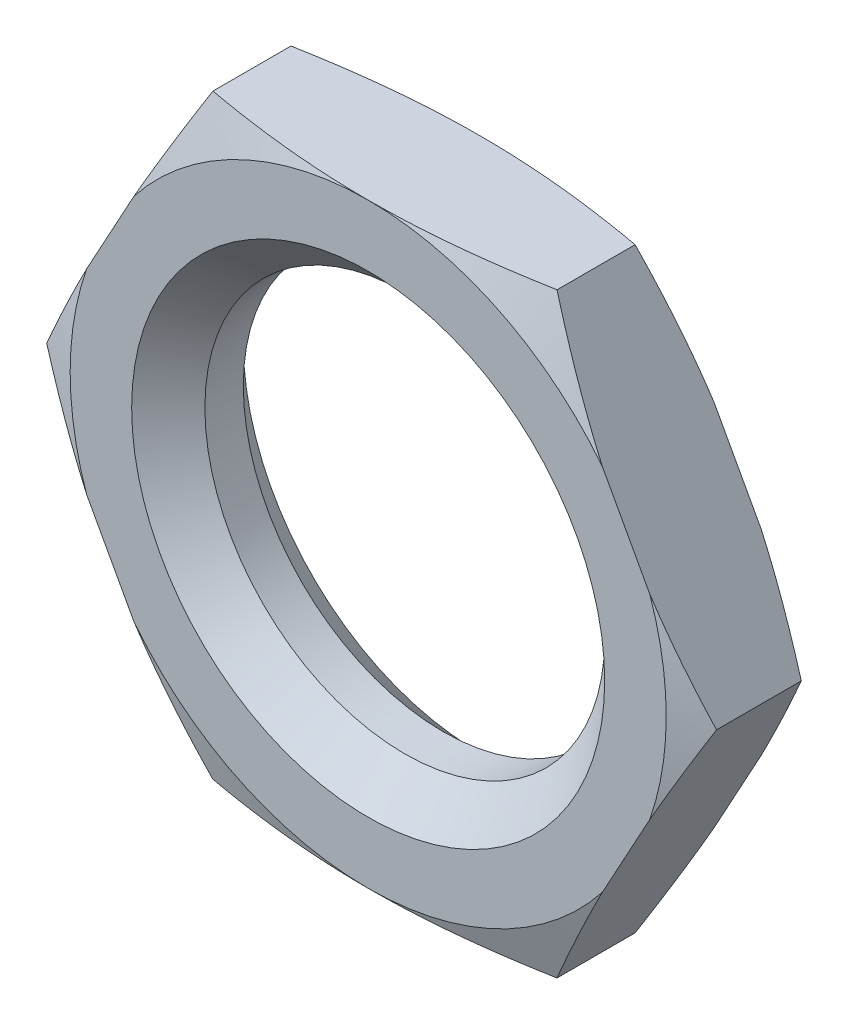
ISO-10303-21;
HEADER;
FILE_DESCRIPTION(('STEP AP214'),'2;1');
FILE_NAME('part.step','',(''),(''),'','','');
FILE_SCHEMA(('AUTOMOTIVE_DESIGN { 1 0 10303 214 1 1 1 1 }'));
ENDSEC;
DATA;
#1=APPLICATION_CONTEXT('core data for automotive mechanical design processes');
#2=APPLICATION_PROTOCOL_DEFINITION('international standard','automotive_design',2000,#1);
#3=PRODUCT_CONTEXT('',#1,'mechanical');
#4=PRODUCT('Part','Part','',(#3));
#5=PRODUCT_RELATED_PRODUCT_CATEGORY('part','',(#4));
#6=PRODUCT_DEFINITION_FORMATION('','',#4);
#7=PRODUCT_DEFINITION_CONTEXT('part definition',#1,'design');
#8=PRODUCT_DEFINITION('design','',#6,#7);
#9=PRODUCT_DEFINITION_SHAPE('','',#8);
#10=(LENGTH_UNIT() NAMED_UNIT(*) SI_UNIT(.MILLI.,.METRE.));
#11=(NAMED_UNIT(*) PLANE_ANGLE_UNIT() SI_UNIT($,.RADIAN.));
#12=(NAMED_UNIT(*) SI_UNIT($,.STERADIAN.) SOLID_ANGLE_UNIT());
#13=UNCERTAINTY_MEASURE_WITH_UNIT(LENGTH_MEASURE(1.E-05),#10,'distance_accuracy_value','');
#14=(GEOMETRIC_REPRESENTATION_CONTEXT(3) GLOBAL_UNCERTAINTY_ASSIGNED_CONTEXT((#13)) GLOBAL_UNIT_ASSIGNED_CONTEXT((#10,
#11,#12)) REPRESENTATION_CONTEXT('',''));
#15=CARTESIAN_POINT('',(0.,0.,0.));
#16=DIRECTION('',(0.,0.,1.));
#17=DIRECTION('',(1.,0.,0.));
#18=AXIS2_PLACEMENT_3D('',#15,#16,#17);
#19=CARTESIAN_POINT('',(0.,0.,0.567943896328416));
#20=DIRECTION('',(0.,0.,-1.));
#21=DIRECTION('',(-1.,0.,0.));
#22=AXIS2_PLACEMENT_3D('',#19,#20,#21);
#23=CONICAL_SURFACE('',#22,4.4987717997742,1.22173047640155);
#24=CARTESIAN_POINT('',(4.4958000232447,-4.25369351651855E-08,0.569025534528027));
#25=CARTESIAN_POINT('',(4.4365571393589,0.10841221946604,0.590588107586124));
#26=CARTESIAN_POINT('',(4.3771937332248,0.217045032676218,0.6107675941967));
#27=CARTESIAN_POINT('',(4.25828859892664,0.434636981742709,0.647962477000906));
#28=CARTESIAN_POINT('',(4.19874705074913,0.543595788230332,0.66498038394323));
#29=CARTESIAN_POINT('',(4.07944584342447,0.761912536123362,0.695491840863877));
#30=CARTESIAN_POINT('',(4.01968615622423,0.871270528864848,0.708984920099625));
#31=CARTESIAN_POINT('',(3.89994833746369,1.09038625935756,0.732120569594249));
#32=CARTESIAN_POINT('',(3.83997006964561,1.20014424645541,0.74176005873124));
#33=CARTESIAN_POINT('',(3.77992612480124,1.31002242005528,0.74930000001725));
#34=B_SPLINE_CURVE_WITH_KNOTS('',3,(#24,#25,#26,#27,#28,#29,#30,#31,#32,#33),.UNSPECIFIED.,.F.,
.F.,(4,2,2,2,4),(0.,0.376239061463251,0.752178045742061,1.12816721123019,1.50445639891164),.UNSPECIFIED.);
#35=CARTESIAN_POINT('',(4.49579997649925,-4.30054841741456E-08,0.569025551541978));
#36=VERTEX_POINT('',#35);
#37=CARTESIAN_POINT('',(3.77992612482661,1.31002242000885,0.749300000014058));
#38=VERTEX_POINT('',#37);
#39=EDGE_CURVE('E139',#36,#38,#34,.T.);
#40=ORIENTED_EDGE('',*,*,#39,.T.);
#41=CARTESIAN_POINT('',(0.,0.,0.749300000010866));
#42=DIRECTION('',(0.,0.,-1.));
#43=DIRECTION('',(-1.,0.,0.));
#44=AXIS2_PLACEMENT_3D('',#41,#42,#43);
#45=CIRCLE('',#44,4.00050000001784);
#46=CARTESIAN_POINT('',(3.77992612482661,-1.31002242000885,0.749300000014058));
#47=VERTEX_POINT('',#46);
#48=EDGE_CURVE('E144',#38,#47,#45,.T.);
#49=ORIENTED_EDGE('',*,*,#48,.T.);
#50=CARTESIAN_POINT('',(3.77992612480123,-1.31002242005528,0.74930000001725));
#51=CARTESIAN_POINT('',(3.83997006370488,-1.20014425732673,0.741760059473885));
#52=CARTESIAN_POINT('',(3.89994832559642,-1.09038628107421,0.732120571499112));
#53=CARTESIAN_POINT('',(4.01968613255412,-0.871270572180271,0.708984925058988));
#54=CARTESIAN_POINT('',(4.07944581387799,-0.761912590192304,0.695491847714452));
#55=CARTESIAN_POINT('',(4.19874700950047,-0.543595863713839,0.664980395199913));
#56=CARTESIAN_POINT('',(4.25828855185213,-0.434637067887287,0.647962490772264));
#57=CARTESIAN_POINT('',(4.37719367453437,-0.217045140077502,0.61076761351038));
#58=CARTESIAN_POINT('',(4.43655707487845,-0.108412337462838,0.590588129928255));
#59=CARTESIAN_POINT('',(4.49579995299851,-8.60109683532284E-08,0.56902556009555));
#60=B_SPLINE_CURVE_WITH_KNOTS('',3,(#50,#51,#52,#53,#54,#55,#56,#57,#58,#59),.UNSPECIFIED.,.F.,
.F.,(4,2,2,2,4),(0.,0.376289150460409,0.752278278804591,1.12821722595912,1.50445625022098),.UNSPECIFIED.);
#61=EDGE_CURVE('E21',#47,#36,#60,.T.);
#62=ORIENTED_EDGE('',*,*,#61,.T.);
#63=EDGE_LOOP('',(#40,#49,#62));
#64=FACE_BOUND('',#63,.T.);
#65=ADVANCED_FACE('F17',(#64),#23,.T.);
#66=CARTESIAN_POINT('',(0.,0.,0.567943896328416));
#67=DIRECTION('',(0.,0.,-1.));
#68=DIRECTION('',(-1.,0.,0.));
#69=AXIS2_PLACEMENT_3D('',#66,#67,#68);
#70=CONICAL_SURFACE('',#69,4.4987717997742,1.22173047640155);
#71=CARTESIAN_POINT('',(-3.77992612480123,1.31002242005528,0.74930000001725));
#72=CARTESIAN_POINT('',(-3.83997006667525,1.20014425189107,0.741760059102563));
#73=CARTESIAN_POINT('',(-3.89994833153005,1.09038627021589,0.73212057054668));
#74=CARTESIAN_POINT('',(-4.01968614438917,0.871270550522559,0.708984922579307));
#75=CARTESIAN_POINT('',(-4.07944582865123,0.761912563157833,0.695491844289165));
#76=CARTESIAN_POINT('',(-4.1987470301248,0.543595825972085,0.664980389571571));
#77=CARTESIAN_POINT('',(-4.25828857538938,0.434637024814997,0.647962483886585));
#78=CARTESIAN_POINT('',(-4.37719370387959,0.217045086376858,0.61076760385354));
#79=CARTESIAN_POINT('',(-4.43655710711868,0.108412278464437,0.59058811875719));
#80=CARTESIAN_POINT('',(-4.4957999881216,2.17370137695074E-08,0.569025547311789));
#81=B_SPLINE_CURVE_WITH_KNOTS('',3,(#71,#72,#73,#74,#75,#76,#77,#78,#79,#80),.UNSPECIFIED.,.F.,
.F.,(4,2,2,2,4),(0.,0.376289169070927,0.752278315987084,1.12821728170375,1.50445632456631),.UNSPECIFIED.);
#82=CARTESIAN_POINT('',(-3.77992612482661,1.31002242000885,0.749300000014058));
#83=VERTEX_POINT('',#82);
#84=CARTESIAN_POINT('',(-4.4957999940608,1.08685065323941E-08,0.569025545150098));
#85=VERTEX_POINT('',#84);
#86=EDGE_CURVE('E164',#83,#85,#81,.T.);
#87=ORIENTED_EDGE('',*,*,#86,.T.);
#88=CARTESIAN_POINT('',(-4.49579998812161,-2.17370160768733E-08,0.569025547311788));
#89=CARTESIAN_POINT('',(-4.43655710711868,-0.108412278464438,0.590588118757189));
#90=CARTESIAN_POINT('',(-4.37719370387959,-0.217045086376859,0.61076760385354));
#91=CARTESIAN_POINT('',(-4.25828857538939,-0.434637024814997,0.647962483886584));
#92=CARTESIAN_POINT('',(-4.19874703012481,-0.543595825972085,0.664980389571571));
#93=CARTESIAN_POINT('',(-4.07944582865123,-0.761912563157832,0.695491844289164));
#94=CARTESIAN_POINT('',(-4.01968614438917,-0.871270550522558,0.708984922579307));
#95=CARTESIAN_POINT('',(-3.89994833153006,-1.09038627021588,0.73212057054668));
#96=CARTESIAN_POINT('',(-3.83997006667525,-1.20014425189107,0.741760059102562));
#97=CARTESIAN_POINT('',(-3.77992612480124,-1.31002242005528,0.74930000001725));
#98=B_SPLINE_CURVE_WITH_KNOTS('',3,(#88,#89,#90,#91,#92,#93,#94,#95,#96,#97),.UNSPECIFIED.,.F.,
.F.,(4,2,2,2,4),(0.,0.376239042862557,0.752178008579225,1.12816715549538,1.50445632456631),.UNSPECIFIED.);
#99=CARTESIAN_POINT('',(-3.77992612482661,-1.31002242000885,0.749300000014058));
#100=VERTEX_POINT('',#99);
#101=EDGE_CURVE('E153',#85,#100,#98,.T.);
#102=ORIENTED_EDGE('',*,*,#101,.T.);
#103=CARTESIAN_POINT('',(0.,0.,0.749300000010866));
#104=DIRECTION('',(0.,0.,-1.));
#105=DIRECTION('',(-1.,0.,0.));
#106=AXIS2_PLACEMENT_3D('',#103,#104,#105);
#107=CIRCLE('',#106,4.00050000001784);
#108=EDGE_CURVE('E157',#100,#83,#107,.T.);
#109=ORIENTED_EDGE('',*,*,#108,.T.);
#110=EDGE_LOOP('',(#87,#102,#109));
#111=FACE_BOUND('',#110,.T.);
#112=ADVANCED_FACE('F172',(#111),#70,.T.);
#113=CARTESIAN_POINT('',(0.,0.,0.7493));
#114=DIRECTION('',(0.,0.,-1.));
#115=DIRECTION('',(-1.,0.,0.));
#116=AXIS2_PLACEMENT_3D('',#113,#114,#115);
#117=PLANE('',#116);
#118=CARTESIAN_POINT('',(0.,0.,0.749300000052244));
#119=DIRECTION('',(0.,0.,1.));
#120=DIRECTION('',(1.,0.,0.));
#121=AXIS2_PLACEMENT_3D('',#118,#119,#120);
#122=CIRCLE('',#121,3.17499999999882);
#123=CARTESIAN_POINT('',(3.17499999999882,0.,0.749300000052244));
#124=VERTEX_POINT('',#123);
#125=EDGE_CURVE('E584',#124,#124,#122,.F.);
#126=ORIENTED_EDGE('',*,*,#125,.T.);
#127=EDGE_LOOP('',(#126));
#128=FACE_BOUND('',#127,.T.);
#129=CARTESIAN_POINT('',(0.,0.,0.749300000010866));
#130=DIRECTION('',(0.,0.,-1.));
#131=DIRECTION('',(-1.,0.,0.));
#132=AXIS2_PLACEMENT_3D('',#129,#130,#131);
#133=CIRCLE('',#132,4.00050000001784);
#134=CARTESIAN_POINT('',(-3.14405148804756,2.47364922549016,0.749300000005433));
#135=VERTEX_POINT('',#134);
#136=CARTESIAN_POINT('',(0.,4.00050000000892,0.749300000014112));
#137=VERTEX_POINT('',#136);
#138=EDGE_CURVE('E579',#135,#137,#133,.T.);
#139=ORIENTED_EDGE('',*,*,#138,.F.);
#140=DIRECTION('',(0.479531480922707,0.877524677034256,0.));
#141=VECTOR('',#140,1.);
#142=CARTESIAN_POINT('',(-3.77992612480037,1.31002242005687,0.7493));
#143=LINE('',#142,#141);
#144=EDGE_CURVE('E582',#83,#135,#143,.T.);
#145=ORIENTED_EDGE('',*,*,#144,.F.);
#146=ORIENTED_EDGE('',*,*,#108,.F.);
#147=DIRECTION('',(-0.479531480922707,0.877524677034256,0.));
#148=VECTOR('',#147,1.);
#149=CARTESIAN_POINT('',(-3.14405148814236,-2.47364922531668,0.7493));
#150=LINE('',#149,#148);
#151=CARTESIAN_POINT('',(-3.14405148804756,-2.47364922549016,0.749300000005433));
#152=VERTEX_POINT('',#151);
#153=EDGE_CURVE('E149',#152,#100,#150,.T.);
#154=ORIENTED_EDGE('',*,*,#153,.F.);
#155=CARTESIAN_POINT('',(0.,0.,0.749300000010866));
#156=DIRECTION('',(0.,0.,-1.));
#157=DIRECTION('',(-1.,0.,0.));
#158=AXIS2_PLACEMENT_3D('',#155,#156,#157);
#159=CIRCLE('',#158,4.00050000001784);
#160=CARTESIAN_POINT('',(0.,-4.00050000000892,0.749300000014112));
#161=VERTEX_POINT('',#160);
#162=EDGE_CURVE('E603',#161,#152,#159,.T.);
#163=ORIENTED_EDGE('',*,*,#162,.F.);
#164=CARTESIAN_POINT('',(0.,0.,0.749300000010866));
#165=DIRECTION('',(0.,0.,-1.));
#166=DIRECTION('',(-1.,0.,0.));
#167=AXIS2_PLACEMENT_3D('',#164,#165,#166);
#168=CIRCLE('',#167,4.00050000001784);
#169=CARTESIAN_POINT('',(3.14405148804756,-2.47364922549016,0.749300000005433));
#170=VERTEX_POINT('',#169);
#171=EDGE_CURVE('E147',#170,#161,#168,.T.);
#172=ORIENTED_EDGE('',*,*,#171,.F.);
#173=DIRECTION('',(-0.479531480922707,-0.877524677034256,0.));
#174=VECTOR('',#173,1.);
#175=CARTESIAN_POINT('',(3.77992612480037,-1.31002242005687,0.7493));
#176=LINE('',#175,#174);
#177=EDGE_CURVE('E132',#47,#170,#176,.T.);
#178=ORIENTED_EDGE('',*,*,#177,.F.);
#179=ORIENTED_EDGE('',*,*,#48,.F.);
#180=DIRECTION('',(0.479531480922707,-0.877524677034256,0.));
#181=VECTOR('',#180,1.);
#182=CARTESIAN_POINT('',(3.14405148814236,2.47364922531668,0.7493));
#183=LINE('',#182,#181);
#184=CARTESIAN_POINT('',(3.14405148804756,2.47364922549016,0.749300000005433));
#185=VERTEX_POINT('',#184);
#186=EDGE_CURVE('E151',#185,#38,#183,.T.);
#187=ORIENTED_EDGE('',*,*,#186,.F.);
#188=CARTESIAN_POINT('',(0.,0.,0.749300000010866));
#189=DIRECTION('',(0.,0.,-1.));
#190=DIRECTION('',(-1.,0.,0.));
#191=AXIS2_PLACEMENT_3D('',#188,#189,#190);
#192=CIRCLE('',#191,4.00050000001784);
#193=EDGE_CURVE('E605',#137,#185,#192,.T.);
#194=ORIENTED_EDGE('',*,*,#193,.F.);
#195=EDGE_LOOP('',(#139,#145,#146,#154,#163,#172,#178,#179,#187,#194));
#196=FACE_BOUND('',#195,.T.);
#197=ADVANCED_FACE('F143',(#128,#196),#117,.F.);
#198=CARTESIAN_POINT('',(0.,0.,0.749300000052244));
#199=DIRECTION('',(0.,0.,1.));
#200=DIRECTION('',(1.,0.,0.));
#201=AXIS2_PLACEMENT_3D('',#198,#199,#200);
#202=CONICAL_SURFACE('',#201,3.17499999999882,0.785398163397448);
#203=ORIENTED_EDGE('',*,*,#125,.F.);
#204=EDGE_LOOP('',(#203));
#205=FACE_BOUND('',#204,.T.);
#206=CARTESIAN_POINT('',(0.,0.,0.25781));
#207=DIRECTION('',(0.,0.,1.));
#208=DIRECTION('',(1.,0.,0.));
#209=AXIS2_PLACEMENT_3D('',#206,#207,#208);
#210=CIRCLE('',#209,2.68351);
#211=CARTESIAN_POINT('',(2.68351,0.,0.25781));
#212=VERTEX_POINT('',#211);
#213=EDGE_CURVE('E573',#212,#212,#210,.F.);
#214=ORIENTED_EDGE('',*,*,#213,.T.);
#215=EDGE_LOOP('',(#214));
#216=FACE_BOUND('',#215,.T.);
#217=ADVANCED_FACE('F180',(#205,#216),#202,.F.);
#218=CARTESIAN_POINT('',(0.,0.,0.522694759808928));
#219=DIRECTION('',(0.,0.,-1.));
#220=DIRECTION('',(-1.,0.,0.));
#221=AXIS2_PLACEMENT_3D('',#218,#219,#220);
#222=CONICAL_SURFACE('',#221,4.62309278054818,1.22173047636786);
#223=CARTESIAN_POINT('',(-2.30968975189267,-4.0005,0.524046282022077));
#224=CARTESIAN_POINT('',(-2.11904174546321,-4.0005,0.558750834898958));
#225=CARTESIAN_POINT('',(-1.92777296199426,-4.0005,0.590332995433367));
#226=CARTESIAN_POINT('',(-1.54454332584392,-4.0005,0.645850789472628));
#227=CARTESIAN_POINT('',(-1.35258473669985,-4.0005,0.669802173573326));
#228=CARTESIAN_POINT('',(-0.96764741070749,-4.0005,0.708820525423857));
#229=CARTESIAN_POINT('',(-0.774668264668581,-4.0005,0.723883605647808));
#230=CARTESIAN_POINT('',(-0.484624893611577,-4.0005,0.73907060207341));
#231=CARTESIAN_POINT('',(-0.387744708693343,-4.0005,0.742898445240856));
#232=CARTESIAN_POINT('',(-0.19391137907643,-4.0005,0.748016420220229));
#233=CARTESIAN_POINT('',(-0.0969582301185669,-4.0005,0.749306390165261));
#234=CARTESIAN_POINT('',(0.,-4.0005,0.749300000017358));
#235=B_SPLINE_CURVE_WITH_KNOTS('',3,(#223,#224,#225,#226,#227,#228,#229,#230,#231,#232,#233,
#234),.UNSPECIFIED.,.F.,.F.,(4,2,2,2,2,4),(0.,0.581392397016227,1.16157685503267,
1.74201488375421,2.03285285361265,2.32370937266917),.UNSPECIFIED.);
#236=CARTESIAN_POINT('',(-2.30968975189299,-4.00049999999981,0.524046282022081));
#237=VERTEX_POINT('',#236);
#238=EDGE_CURVE('E202',#237,#161,#235,.T.);
#239=ORIENTED_EDGE('',*,*,#238,.T.);
#240=ORIENTED_EDGE('',*,*,#162,.T.);
#241=CARTESIAN_POINT('',(-3.14405148814164,-2.473649225318,0.749300000017268));
#242=CARTESIAN_POINT('',(-3.07397134721236,-2.60189326242928,0.740507062941832));
#243=CARTESIAN_POINT('',(-3.00398367441072,-2.72996808632502,0.728844522249659));
#244=CARTESIAN_POINT('',(-2.8643212233145,-2.98554514886991,0.700343139022528));
#245=CARTESIAN_POINT('',(-2.79464619973965,-3.11304783637276,0.683509556223475));
#246=CARTESIAN_POINT('',(-2.65560924732973,-3.36748025971352,0.645212950503537));
#247=CARTESIAN_POINT('',(-2.58624725594932,-3.49441011000703,0.623750898352939));
#248=CARTESIAN_POINT('',(-2.44776538094582,-3.74782676245227,0.57678062770743));
#249=CARTESIAN_POINT('',(-2.37864581459912,-3.87431298400008,0.551268323643238));
#250=CARTESIAN_POINT('',(-2.3096897518933,-4.00049999999962,0.524046282022084));
#251=B_SPLINE_CURVE_WITH_KNOTS('',3,(#241,#242,#243,#244,#245,#246,#247,#248,#249,#250),
.UNSPECIFIED.,.F.,.F.,(4,2,2,2,4),(0.,0.43916486138915,0.877884496221608,1.3165122037959,
1.75558520848354),.UNSPECIFIED.);
#252=EDGE_CURVE('E195',#152,#237,#251,.T.);
#253=ORIENTED_EDGE('',*,*,#252,.T.);
#254=EDGE_LOOP('',(#239,#240,#253));
#255=FACE_BOUND('',#254,.T.);
#256=ADVANCED_FACE('F184',(#255),#222,.T.);
#257=CARTESIAN_POINT('',(0.,0.,0.522694759808928));
#258=DIRECTION('',(0.,0.,-1.));
#259=DIRECTION('',(-1.,0.,0.));
#260=AXIS2_PLACEMENT_3D('',#257,#258,#259);
#261=CONICAL_SURFACE('',#260,4.62309278054818,1.22173047636786);
#262=CARTESIAN_POINT('',(2.30968975189331,-4.00049999999962,0.524046282022083));
#263=CARTESIAN_POINT('',(2.37864581459913,-3.87431298400008,0.551268323643237));
#264=CARTESIAN_POINT('',(2.44776538094583,-3.74782676245227,0.576780627707428));
#265=CARTESIAN_POINT('',(2.58624725594933,-3.49441011000702,0.623750898352938));
#266=CARTESIAN_POINT('',(2.65560924732973,-3.36748025971352,0.645212950503536));
#267=CARTESIAN_POINT('',(2.79464619973966,-3.11304783637276,0.683509556223475));
#268=CARTESIAN_POINT('',(2.8643212233145,-2.98554514886991,0.700343139022528));
#269=CARTESIAN_POINT('',(3.00398367441072,-2.72996808632502,0.728844522249658));
#270=CARTESIAN_POINT('',(3.07397134721236,-2.60189326242928,0.740507062941831));
#271=CARTESIAN_POINT('',(3.14405148814164,-2.473649225318,0.749300000017268));
#272=B_SPLINE_CURVE_WITH_KNOTS('',3,(#262,#263,#264,#265,#266,#267,#268,#269,#270,#271),
.UNSPECIFIED.,.F.,.F.,(4,2,2,2,4),(0.,0.439073004687638,0.877700712261928,1.31642034709439,
1.75558520848354),.UNSPECIFIED.);
#273=CARTESIAN_POINT('',(2.3096897518932,-4.00049999999981,0.524046282022041));
#274=VERTEX_POINT('',#273);
#275=EDGE_CURVE('E565',#274,#170,#272,.T.);
#276=ORIENTED_EDGE('',*,*,#275,.T.);
#277=ORIENTED_EDGE('',*,*,#171,.T.);
#278=CARTESIAN_POINT('',(0.,-4.0005,0.749300000017358));
#279=CARTESIAN_POINT('',(0.0969582301185686,-4.0005,0.749306390165261));
#280=CARTESIAN_POINT('',(0.193911379076432,-4.0005,0.748016420220229));
#281=CARTESIAN_POINT('',(0.387744708693345,-4.0005,0.742898445240856));
#282=CARTESIAN_POINT('',(0.484624893611579,-4.0005,0.73907060207341));
#283=CARTESIAN_POINT('',(0.774668264668583,-4.0005,0.723883605647808));
#284=CARTESIAN_POINT('',(0.967647410707493,-4.0005,0.708820525423857));
#285=CARTESIAN_POINT('',(1.35258473669985,-4.0005,0.669802173573326));
#286=CARTESIAN_POINT('',(1.54454332584392,-4.0005,0.645850789472627));
#287=CARTESIAN_POINT('',(1.92777296199426,-4.0005,0.590332995433366));
#288=CARTESIAN_POINT('',(2.11904174546321,-4.0005,0.558750834898958));
#289=CARTESIAN_POINT('',(2.30968975189268,-4.0005,0.524046282022077));
#290=B_SPLINE_CURVE_WITH_KNOTS('',3,(#278,#279,#280,#281,#282,#283,#284,#285,#286,#287,#288,
#289),.UNSPECIFIED.,.F.,.F.,(4,2,2,2,2,4),(0.,0.290856519056519,0.581694488914956,
1.1621325176365,1.74231697565294,2.32370937266917),.UNSPECIFIED.);
#291=EDGE_CURVE('E210',#161,#274,#290,.T.);
#292=ORIENTED_EDGE('',*,*,#291,.T.);
#293=EDGE_LOOP('',(#276,#277,#292));
#294=FACE_BOUND('',#293,.T.);
#295=ADVANCED_FACE('F189',(#294),#261,.T.);
#296=CARTESIAN_POINT('',(0.,0.,0.522694759808928));
#297=DIRECTION('',(0.,0.,-1.));
#298=DIRECTION('',(-1.,0.,0.));
#299=AXIS2_PLACEMENT_3D('',#296,#297,#298);
#300=CONICAL_SURFACE('',#299,4.62309278054818,1.22173047636786);
#301=CARTESIAN_POINT('',(2.30968975189268,4.0005,0.524046282022077));
#302=CARTESIAN_POINT('',(2.11904174546321,4.0005,0.558750834898958));
#303=CARTESIAN_POINT('',(1.92777296199426,4.0005,0.590332995433367));
#304=CARTESIAN_POINT('',(1.54454332584392,4.0005,0.645850789472628));
#305=CARTESIAN_POINT('',(1.35258473669985,4.0005,0.669802173573326));
#306=CARTESIAN_POINT('',(0.967647410707491,4.0005,0.708820525423857));
#307=CARTESIAN_POINT('',(0.774668264668582,4.0005,0.723883605647808));
#308=CARTESIAN_POINT('',(0.484624893611578,4.0005,0.73907060207341));
#309=CARTESIAN_POINT('',(0.387744708693344,4.0005,0.742898445240856));
#310=CARTESIAN_POINT('',(0.193911379076431,4.0005,0.748016420220229));
#311=CARTESIAN_POINT('',(0.0969582301185679,4.0005,0.749306390165261));
#312=CARTESIAN_POINT('',(0.,4.0005,0.749300000017358));
#313=B_SPLINE_CURVE_WITH_KNOTS('',3,(#301,#302,#303,#304,#305,#306,#307,#308,#309,#310,#311,
#312),.UNSPECIFIED.,.F.,.F.,(4,2,2,2,2,4),(0.,0.581392397016227,1.16157685503267,
1.74201488375421,2.03285285361265,2.32370937266917),.UNSPECIFIED.);
#314=CARTESIAN_POINT('',(2.30968975189299,4.00049999999981,0.52404628202208));
#315=VERTEX_POINT('',#314);
#316=EDGE_CURVE('E288',#315,#137,#313,.T.);
#317=ORIENTED_EDGE('',*,*,#316,.T.);
#318=ORIENTED_EDGE('',*,*,#193,.T.);
#319=CARTESIAN_POINT('',(3.14405148814164,2.473649225318,0.749300000017268));
#320=CARTESIAN_POINT('',(3.07397134721236,2.60189326242928,0.740507062941832));
#321=CARTESIAN_POINT('',(3.00398367441072,2.72996808632502,0.728844522249659));
#322=CARTESIAN_POINT('',(2.8643212233145,2.98554514886991,0.700343139022529));
#323=CARTESIAN_POINT('',(2.79464619973965,3.11304783637276,0.683509556223475));
#324=CARTESIAN_POINT('',(2.65560924732973,3.36748025971352,0.645212950503537));
#325=CARTESIAN_POINT('',(2.58624725594932,3.49441011000702,0.623750898352939));
#326=CARTESIAN_POINT('',(2.44776538094582,3.74782676245227,0.57678062770743));
#327=CARTESIAN_POINT('',(2.37864581459912,3.87431298400008,0.551268323643238));
#328=CARTESIAN_POINT('',(2.3096897518933,4.00049999999962,0.524046282022084));
#329=B_SPLINE_CURVE_WITH_KNOTS('',3,(#319,#320,#321,#322,#323,#324,#325,#326,#327,#328),
.UNSPECIFIED.,.F.,.F.,(4,2,2,2,4),(0.,0.43916486138915,0.877884496221607,1.3165122037959,
1.75558520848354),.UNSPECIFIED.);
#330=EDGE_CURVE('E309',#185,#315,#329,.T.);
#331=ORIENTED_EDGE('',*,*,#330,.T.);
#332=EDGE_LOOP('',(#317,#318,#331));
#333=FACE_BOUND('',#332,.T.);
#334=ADVANCED_FACE('F299',(#333),#300,.T.);
#335=CARTESIAN_POINT('',(0.,0.,0.522694759808928));
#336=DIRECTION('',(0.,0.,-1.));
#337=DIRECTION('',(-1.,0.,0.));
#338=AXIS2_PLACEMENT_3D('',#335,#336,#337);
#339=CONICAL_SURFACE('',#338,4.62309278054818,1.22173047636786);
#340=CARTESIAN_POINT('',(-2.30968975189331,4.00049999999962,0.524046282022083));
#341=CARTESIAN_POINT('',(-2.37864581459913,3.87431298400008,0.551268323643237));
#342=CARTESIAN_POINT('',(-2.44776538094583,3.74782676245227,0.576780627707429));
#343=CARTESIAN_POINT('',(-2.58624725594933,3.49441011000703,0.623750898352938));
#344=CARTESIAN_POINT('',(-2.65560924732973,3.36748025971352,0.645212950503536));
#345=CARTESIAN_POINT('',(-2.79464619973966,3.11304783637276,0.683509556223474));
#346=CARTESIAN_POINT('',(-2.8643212233145,2.98554514886991,0.700343139022528));
#347=CARTESIAN_POINT('',(-3.00398367441072,2.72996808632502,0.728844522249658));
#348=CARTESIAN_POINT('',(-3.07397134721236,2.60189326242928,0.740507062941832));
#349=CARTESIAN_POINT('',(-3.14405148814164,2.473649225318,0.749300000017268));
#350=B_SPLINE_CURVE_WITH_KNOTS('',3,(#340,#341,#342,#343,#344,#345,#346,#347,#348,#349),
.UNSPECIFIED.,.F.,.F.,(4,2,2,2,4),(0.,0.439073004687638,0.877700712261928,1.31642034709439,
1.75558520848354),.UNSPECIFIED.);
#351=CARTESIAN_POINT('',(-2.3096897518932,4.00049999999981,0.524046282022041));
#352=VERTEX_POINT('',#351);
#353=EDGE_CURVE('E303',#352,#135,#350,.T.);
#354=ORIENTED_EDGE('',*,*,#353,.T.);
#355=ORIENTED_EDGE('',*,*,#138,.T.);
#356=CARTESIAN_POINT('',(0.,4.0005,0.749300000017358));
#357=CARTESIAN_POINT('',(-0.0969582301185686,4.0005,0.749306390165261));
#358=CARTESIAN_POINT('',(-0.193911379076432,4.0005,0.748016420220229));
#359=CARTESIAN_POINT('',(-0.387744708693345,4.0005,0.742898445240856));
#360=CARTESIAN_POINT('',(-0.484624893611579,4.0005,0.73907060207341));
#361=CARTESIAN_POINT('',(-0.774668264668583,4.0005,0.723883605647808));
#362=CARTESIAN_POINT('',(-0.967647410707493,4.0005,0.708820525423857));
#363=CARTESIAN_POINT('',(-1.35258473669985,4.0005,0.669802173573326));
#364=CARTESIAN_POINT('',(-1.54454332584392,4.0005,0.645850789472627));
#365=CARTESIAN_POINT('',(-1.92777296199426,4.0005,0.590332995433366));
#366=CARTESIAN_POINT('',(-2.11904174546321,4.0005,0.558750834898958));
#367=CARTESIAN_POINT('',(-2.30968975189268,4.0005,0.524046282022077));
#368=B_SPLINE_CURVE_WITH_KNOTS('',3,(#356,#357,#358,#359,#360,#361,#362,#363,#364,#365,#366,
#367),.UNSPECIFIED.,.F.,.F.,(4,2,2,2,2,4),(0.,0.290856519056519,0.581694488914956,
1.1621325176365,1.74231697565294,2.32370937266917),.UNSPECIFIED.);
#369=EDGE_CURVE('E280',#137,#352,#368,.T.);
#370=ORIENTED_EDGE('',*,*,#369,.T.);
#371=EDGE_LOOP('',(#354,#355,#370));
#372=FACE_BOUND('',#371,.T.);
#373=ADVANCED_FACE('F295',(#372),#339,.T.);
#374=CARTESIAN_POINT('',(0.,0.,-0.7493));
#375=DIRECTION('',(0.,0.,1.));
#376=DIRECTION('',(1.,0.,0.));
#377=AXIS2_PLACEMENT_3D('',#374,#375,#376);
#378=CYLINDRICAL_SURFACE('',#377,2.68351);
#379=ORIENTED_EDGE('',*,*,#213,.F.);
#380=EDGE_LOOP('',(#379));
#381=FACE_BOUND('',#380,.T.);
#382=CARTESIAN_POINT('',(0.,0.,-0.25781000005054));
#383=DIRECTION('',(0.,0.,-1.));
#384=DIRECTION('',(-1.,0.,0.));
#385=AXIS2_PLACEMENT_3D('',#382,#383,#384);
#386=CIRCLE('',#385,2.68350999999711);
#387=CARTESIAN_POINT('',(-2.68350999999711,0.,-0.25781000005054));
#388=VERTEX_POINT('',#387);
#389=EDGE_CURVE('E279',#388,#388,#386,.T.);
#390=ORIENTED_EDGE('',*,*,#389,.T.);
#391=EDGE_LOOP('',(#390));
#392=FACE_BOUND('',#391,.T.);
#393=ADVANCED_FACE('F298',(#381,#392),#378,.F.);
#394=CARTESIAN_POINT('',(-4.4958,0.,1.4986));
#395=DIRECTION('',(0.877524677034256,0.479531480922707,0.));
#396=DIRECTION('',(-0.479531480922707,0.877524677034256,0.));
#397=AXIS2_PLACEMENT_3D('',#394,#395,#396);
#398=PLANE('',#397);
#399=CARTESIAN_POINT('',(-3.77992612480025,-1.31002242005708,-0.74929999996053));
#400=CARTESIAN_POINT('',(-3.83997006370371,-1.20014425732887,-0.741760059416569));
#401=CARTESIAN_POINT('',(-3.89994832559505,-1.09038628107673,-0.732120571441034));
#402=CARTESIAN_POINT('',(-4.0196861325523,-0.871270572183592,-0.708984924999092));
#403=CARTESIAN_POINT('',(-4.07944581387594,-0.761912590196059,-0.695491847653498));
#404=CARTESIAN_POINT('',(-4.19874700949791,-0.543595863718524,-0.664980395136579));
#405=CARTESIAN_POINT('',(-4.2582885518493,-0.434637067892468,-0.647962490707607));
#406=CARTESIAN_POINT('',(-4.37719367453097,-0.217045140083728,-0.610767613442844));
#407=CARTESIAN_POINT('',(-4.43655707487475,-0.108412337469612,-0.59058812985916));
#408=CARTESIAN_POINT('',(-4.49579995299449,-8.6018323776957E-08,-0.569025560024796));
#409=B_SPLINE_CURVE_WITH_KNOTS('',3,(#399,#400,#401,#402,#403,#404,#405,#406,#407,#408),
.UNSPECIFIED.,.F.,.F.,(4,2,2,2,4),(0.,0.376289150459314,0.752278278802354,1.12821722595573,
1.50445625021649),.UNSPECIFIED.);
#410=CARTESIAN_POINT('',(-3.77992612466924,-1.31002242029683,-0.749299999977011));
#411=VERTEX_POINT('',#410);
#412=CARTESIAN_POINT('',(-4.49579997649724,-4.30091624879934E-08,-0.569025551470494));
#413=VERTEX_POINT('',#412);
#414=EDGE_CURVE('E274',#411,#413,#409,.T.);
#415=ORIENTED_EDGE('',*,*,#414,.F.);
#416=DIRECTION('',(-0.479531480922707,0.877524677034256,0.));
#417=VECTOR('',#416,1.);
#418=CARTESIAN_POINT('',(-4.4958,0.,-0.7493));
#419=LINE('',#418,#417);
#420=CARTESIAN_POINT('',(-3.14405148827349,-2.47364922507671,-0.749299999977011));
#421=VERTEX_POINT('',#420);
#422=EDGE_CURVE('E386',#421,#411,#419,.T.);
#423=ORIENTED_EDGE('',*,*,#422,.F.);
#424=CARTESIAN_POINT('',(-2.30968970048862,-4.00050001039158,-0.524046245356606));
#425=CARTESIAN_POINT('',(-2.37864578572553,-3.87431300663461,-0.551268306625714));
#426=CARTESIAN_POINT('',(-2.44776536232619,-3.74782678839761,-0.576780619307495));
#427=CARTESIAN_POINT('',(-2.586247246869,-3.49441013474332,-0.623750897259498));
#428=CARTESIAN_POINT('',(-2.6556092375455,-3.36748027993856,-0.645212948112841));
#429=CARTESIAN_POINT('',(-2.79464619118052,-3.11304784971489,-0.683509553456973));
#430=CARTESIAN_POINT('',(-2.86432121668448,-2.98554515984161,-0.700343137184934));
#431=CARTESIAN_POINT('',(-3.00398367173033,-2.72996809239218,-0.728844522078744));
#432=CARTESIAN_POINT('',(-3.07397134655275,-2.60189326596181,-0.740507063502767));
#433=CARTESIAN_POINT('',(-3.14405148814247,-2.47364922531646,-0.74929999996053));
#434=B_SPLINE_CURVE_WITH_KNOTS('',3,(#424,#425,#426,#427,#428,#429,#430,#431,#432,#433),
.UNSPECIFIED.,.F.,.F.,(4,2,2,2,4),(0.,0.439073015116604,0.877700732694713,1.31642037687126,
1.75558524809707),.UNSPECIFIED.);
#435=CARTESIAN_POINT('',(-2.30968970615158,-4.0005,-0.524046290302312));
#436=VERTEX_POINT('',#435);
#437=EDGE_CURVE('E249',#436,#421,#434,.T.);
#438=ORIENTED_EDGE('',*,*,#437,.F.);
#439=DIRECTION('',(0.,0.,1.));
#440=VECTOR('',#439,1.);
#441=CARTESIAN_POINT('',(-2.3096897518931,-4.0005,1.4986));
#442=LINE('',#441,#440);
#443=EDGE_CURVE('E598',#436,#237,#442,.T.);
#444=ORIENTED_EDGE('',*,*,#443,.T.);
#445=ORIENTED_EDGE('',*,*,#252,.F.);
#446=ORIENTED_EDGE('',*,*,#153,.T.);
#447=ORIENTED_EDGE('',*,*,#101,.F.);
#448=DIRECTION('',(0.,0.,1.));
#449=VECTOR('',#448,1.);
#450=CARTESIAN_POINT('',(-4.4958,0.,1.4986));
#451=LINE('',#450,#449);
#452=EDGE_CURVE('E308',#85,#413,#451,.F.);
#453=ORIENTED_EDGE('',*,*,#452,.T.);
#454=EDGE_LOOP('',(#415,#423,#438,#444,#445,#446,#447,#453));
#455=FACE_BOUND('',#454,.T.);
#456=ADVANCED_FACE('F169',(#455),#398,.F.);
#457=CARTESIAN_POINT('',(2.3096897518931,-4.0005,1.4986));
#458=DIRECTION('',(-0.877524677034257,0.479531480922706,0.));
#459=DIRECTION('',(-0.479531480922706,-0.877524677034257,0.));
#460=AXIS2_PLACEMENT_3D('',#457,#458,#459);
#461=PLANE('',#460);
#462=CARTESIAN_POINT('',(3.14405148814247,-2.47364922531647,-0.749299999960529));
#463=CARTESIAN_POINT('',(3.07397135098923,-2.60189325551775,-0.740507063356418));
#464=CARTESIAN_POINT('',(3.00398368195243,-2.72996807252398,-0.728844523448548));
#465=CARTESIAN_POINT('',(2.86432123834689,-2.9855451213612,-0.700343142318569));
#466=CARTESIAN_POINT('',(2.79464621849794,-3.1130478020458,-0.683509560831398));
#467=CARTESIAN_POINT('',(2.65560927350044,-3.3674802118221,-0.64521295816839));
#468=CARTESIAN_POINT('',(2.58624728580659,-3.49441005536935,-0.623750907762598));
#469=CARTESIAN_POINT('',(2.44776541815075,-3.74782669436865,-0.576780640946737));
#470=CARTESIAN_POINT('',(2.3786458554651,-3.87431290921687,-0.551268338968061));
#471=CARTESIAN_POINT('',(2.30968979640353,-4.00049991854758,-0.524046299552212));
#472=B_SPLINE_CURVE_WITH_KNOTS('',3,(#462,#463,#464,#465,#466,#467,#468,#469,#470,#471),
.UNSPECIFIED.,.F.,.F.,(4,2,2,2,4),(0.,0.439164837734707,0.87788444897294,1.31651213297218,
1.75558511402455),.UNSPECIFIED.);
#473=CARTESIAN_POINT('',(3.14405148827349,-2.47364922507671,-0.749299999977011));
#474=VERTEX_POINT('',#473);
#475=CARTESIAN_POINT('',(2.30968977414815,-4.00049995927408,-0.52404629076506));
#476=VERTEX_POINT('',#475);
#477=EDGE_CURVE('E365',#474,#476,#472,.T.);
#478=ORIENTED_EDGE('',*,*,#477,.F.);
#479=DIRECTION('',(-0.479531480922706,-0.877524677034257,0.));
#480=VECTOR('',#479,1.);
#481=CARTESIAN_POINT('',(2.3096897518931,-4.0005,-0.7493));
#482=LINE('',#481,#480);
#483=CARTESIAN_POINT('',(3.77992612466924,-1.31002242029683,-0.749299999977011));
#484=VERTEX_POINT('',#483);
#485=EDGE_CURVE('E211',#484,#474,#482,.T.);
#486=ORIENTED_EDGE('',*,*,#485,.F.);
#487=CARTESIAN_POINT('',(4.49579996878491,-1.41418048295316E-08,-0.569025532344247));
#488=CARTESIAN_POINT('',(4.43655710005208,-0.108412275880736,-0.5905881133399));
#489=CARTESIAN_POINT('',(4.37719370186082,-0.217045085895431,-0.610767602384426));
#490=CARTESIAN_POINT('',(4.2582885770771,-0.434637025898906,-0.647962485323522));
#491=CARTESIAN_POINT('',(4.1987470304764,-0.543595826520912,-0.664980389971914));
#492=CARTESIAN_POINT('',(4.0794458279804,-0.76191256319304,-0.695491843844935));
#493=CARTESIAN_POINT('',(4.0196861440324,-0.871270550579001,-0.708984922330129));
#494=CARTESIAN_POINT('',(3.89994833176863,-1.09038627037621,-0.73212057070031));
#495=CARTESIAN_POINT('',(3.83997006719502,-1.20014425213421,-0.741760059461778));
#496=CARTESIAN_POINT('',(3.77992612479978,-1.31002242005794,-0.749299999960589));
#497=B_SPLINE_CURVE_WITH_KNOTS('',3,(#487,#488,#489,#490,#491,#492,#493,#494,#495,#496),
.UNSPECIFIED.,.F.,.F.,(4,2,2,2,4),(0.,0.376239043057248,0.752178008782089,1.12816715540123,
1.50445632438666),.UNSPECIFIED.);
#498=CARTESIAN_POINT('',(4.49579999405898,-1.08718324495034E-08,-0.569025545078543));
#499=VERTEX_POINT('',#498);
#500=EDGE_CURVE('E216',#499,#484,#497,.T.);
#501=ORIENTED_EDGE('',*,*,#500,.F.);
#502=DIRECTION('',(0.,0.,1.));
#503=VECTOR('',#502,1.);
#504=CARTESIAN_POINT('',(4.4958,0.,1.4986));
#505=LINE('',#504,#503);
#506=EDGE_CURVE('E135',#499,#36,#505,.T.);
#507=ORIENTED_EDGE('',*,*,#506,.T.);
#508=ORIENTED_EDGE('',*,*,#61,.F.);
#509=ORIENTED_EDGE('',*,*,#177,.T.);
#510=ORIENTED_EDGE('',*,*,#275,.F.);
#511=DIRECTION('',(0.,0.,1.));
#512=VECTOR('',#511,1.);
#513=CARTESIAN_POINT('',(2.3096897518931,-4.0005,1.4986));
#514=LINE('',#513,#512);
#515=EDGE_CURVE('E599',#274,#476,#514,.F.);
#516=ORIENTED_EDGE('',*,*,#515,.T.);
#517=EDGE_LOOP('',(#478,#486,#501,#507,#508,#509,#510,#516));
#518=FACE_BOUND('',#517,.T.);
#519=ADVANCED_FACE('F131',(#518),#461,.F.);
#520=CARTESIAN_POINT('',(-2.3096897518931,-4.0005,1.4986));
#521=DIRECTION('',(0.,1.,0.));
#522=DIRECTION('',(0.,0.,1.));
#523=AXIS2_PLACEMENT_3D('',#520,#521,#522);
#524=PLANE('',#523);
#525=CARTESIAN_POINT('',(0.,-4.0005,-0.749299999960514));
#526=CARTESIAN_POINT('',(-0.0969582262290942,-4.0005,-0.749306390107406));
#527=CARTESIAN_POINT('',(-0.193911371298117,-4.0005,-0.748016420266491));
#528=CARTESIAN_POINT('',(-0.387744693146543,-4.0005,-0.742898445696903));
#529=CARTESIAN_POINT('',(-0.48462487418513,-4.0005,-0.739070602835086));
#530=CARTESIAN_POINT('',(-0.774668233665641,-4.0005,-0.723883607612678));
#531=CARTESIAN_POINT('',(-0.967647372029481,-4.0005,-0.708820528572697));
#532=CARTESIAN_POINT('',(-1.35258468278679,-4.0005,-0.669802179703828));
#533=CARTESIAN_POINT('',(-1.54454326437078,-4.0005,-0.64585079740005));
#534=CARTESIAN_POINT('',(-1.92777288546119,-4.0005,-0.590333007404434));
#535=CARTESIAN_POINT('',(-2.11904166143063,-4.0005,-0.558750849118604));
#536=CARTESIAN_POINT('',(-2.30968966041007,-4.0005,-0.524046298626586));
#537=B_SPLINE_CURVE_WITH_KNOTS('',3,(#525,#526,#527,#528,#529,#530,#531,#532,#533,#534,#535,
#536),.UNSPECIFIED.,.F.,.F.,(4,2,2,2,2,4),(0.,0.29085650739029,0.581694465586214,
1.16213247110448,1.74231690596055,2.32370927969665),.UNSPECIFIED.);
#538=CARTESIAN_POINT('',(0.,-4.00050000000892,-0.749299999957268));
#539=VERTEX_POINT('',#538);
#540=EDGE_CURVE('E241',#539,#436,#537,.T.);
#541=ORIENTED_EDGE('',*,*,#540,.F.);
#542=CARTESIAN_POINT('',(2.30968978646365,-4.00049995928065,-0.524046245189128));
#543=CARTESIAN_POINT('',(2.11904177969625,-4.00049998541225,-0.558750818140077));
#544=CARTESIAN_POINT('',(1.92777299402471,-4.00049999609993,-0.590332987450093));
#545=CARTESIAN_POINT('',(1.54454335200846,-4.00050000389196,-0.645850788918709));
#546=CARTESIAN_POINT('',(1.35258475920564,-4.00050000102448,-0.669802171701882));
#547=CARTESIAN_POINT('',(0.96764742660677,-4.00049999897507,-0.708820523294937));
#548=CARTESIAN_POINT('',(0.774668277621797,-4.00049999979475,-0.723883604594609));
#549=CARTESIAN_POINT('',(0.484624901918033,-4.00050000010284,-0.739070601742504));
#550=CARTESIAN_POINT('',(0.387744715362696,-4.00050000005142,-0.742898445001835));
#551=CARTESIAN_POINT('',(0.193911382425239,-4.00049999994857,-0.74801642008162));
#552=CARTESIAN_POINT('',(0.0969582317839057,-4.00049999989714,-0.749306390034052));
#553=CARTESIAN_POINT('',(0.,-4.0005,-0.749299999960514));
#554=B_SPLINE_CURVE_WITH_KNOTS('',3,(#542,#543,#544,#545,#546,#547,#548,#549,#550,#551,#552,
#553),.UNSPECIFIED.,.F.,.F.,(4,2,2,2,2,4),(0.,0.581392407790235,1.16157687595997,
1.74201491388605,2.03285288864741,2.32370941273581),.UNSPECIFIED.);
#555=EDGE_CURVE('E233',#476,#539,#554,.T.);
#556=ORIENTED_EDGE('',*,*,#555,.F.);
#557=ORIENTED_EDGE('',*,*,#515,.F.);
#558=ORIENTED_EDGE('',*,*,#291,.F.);
#559=ORIENTED_EDGE('',*,*,#238,.F.);
#560=ORIENTED_EDGE('',*,*,#443,.F.);
#561=EDGE_LOOP('',(#541,#556,#557,#558,#559,#560));
#562=FACE_BOUND('',#561,.T.);
#563=ADVANCED_FACE('F221',(#562),#524,.F.);
#564=CARTESIAN_POINT('',(4.4958,0.,1.4986));
#565=DIRECTION('',(-0.877524677034256,-0.479531480922707,0.));
#566=DIRECTION('',(0.479531480922707,-0.877524677034256,0.));
#567=AXIS2_PLACEMENT_3D('',#564,#565,#566);
#568=PLANE('',#567);
#569=CARTESIAN_POINT('',(3.77992612480025,1.31002242005707,-0.74929999996053));
#570=CARTESIAN_POINT('',(3.83997006660583,1.2001442520181,-0.741760059053778));
#571=CARTESIAN_POINT('',(3.89994833139235,1.09038627046788,-0.732120570510486));
#572=CARTESIAN_POINT('',(4.01968614411544,0.871270551023485,-0.708984922576383));
#573=CARTESIAN_POINT('',(4.07944582830975,0.761912563782729,-0.69549184430691));
#574=CARTESIAN_POINT('',(4.19874702964838,0.543595826843922,-0.664980389637554));
#575=CARTESIAN_POINT('',(4.25828857484576,0.434637025809805,-0.647962483980133));
#576=CARTESIAN_POINT('',(4.37719370320195,0.217045087616907,-0.610767604007879));
#577=CARTESIAN_POINT('',(4.43655710637423,0.108412279826755,-0.59058811894476));
#578=CARTESIAN_POINT('',(4.4957999873106,2.32211256227898E-08,-0.569025547534754));
#579=B_SPLINE_CURVE_WITH_KNOTS('',3,(#569,#570,#571,#572,#573,#574,#575,#576,#577,#578),
.UNSPECIFIED.,.F.,.F.,(4,2,2,2,4),(0.,0.376289168642237,0.752278315130543,1.12821728041958,
1.50445632285366),.UNSPECIFIED.);
#580=CARTESIAN_POINT('',(3.77992612466924,1.31002242029683,-0.749299999977011));
#581=VERTEX_POINT('',#580);
#582=EDGE_CURVE('E356',#581,#499,#579,.T.);
#583=ORIENTED_EDGE('',*,*,#582,.F.);
#584=DIRECTION('',(0.479531480922707,-0.877524677034256,0.));
#585=VECTOR('',#584,1.);
#586=CARTESIAN_POINT('',(4.4958,0.,-0.7493));
#587=LINE('',#586,#585);
#588=CARTESIAN_POINT('',(3.14405148827349,2.47364922507671,-0.749299999977011));
#589=VERTEX_POINT('',#588);
#590=EDGE_CURVE('E589',#589,#581,#587,.T.);
#591=ORIENTED_EDGE('',*,*,#590,.F.);
#592=CARTESIAN_POINT('',(2.3096897004846,4.00050001035772,-0.524046245346974));
#593=CARTESIAN_POINT('',(2.37864578573086,3.87431300660997,-0.551268306624708));
#594=CARTESIAN_POINT('',(2.44776536233482,3.74782678837781,-0.576780619309738));
#595=CARTESIAN_POINT('',(2.58624724687881,3.49441013472936,-0.62375089726351));
#596=CARTESIAN_POINT('',(2.65560923755321,3.3674802799256,-0.645212948115381));
#597=CARTESIAN_POINT('',(2.79464619118528,3.11304784970503,-0.683509553457866));
#598=CARTESIAN_POINT('',(2.86432121668841,2.98554515983386,-0.700343137185658));
#599=CARTESIAN_POINT('',(3.00398367173261,2.72996809238857,-0.728844522079287));
#600=CARTESIAN_POINT('',(3.07397134655423,2.60189326596024,-0.740507063503296));
#601=CARTESIAN_POINT('',(3.14405148814247,2.47364922531647,-0.74929999996053));
#602=B_SPLINE_CURVE_WITH_KNOTS('',3,(#592,#593,#594,#595,#596,#597,#598,#599,#600,#601),
.UNSPECIFIED.,.F.,.F.,(4,2,2,2,4),(0.,0.43907301511043,0.877700732682183,1.31642037685204,
1.75558524807137),.UNSPECIFIED.);
#603=CARTESIAN_POINT('',(2.30968970613862,4.0005,-0.52404629030467));
#604=VERTEX_POINT('',#603);
#605=EDGE_CURVE('E328',#604,#589,#602,.T.);
#606=ORIENTED_EDGE('',*,*,#605,.F.);
#607=DIRECTION('',(0.,0.,-1.));
#608=VECTOR('',#607,1.);
#609=CARTESIAN_POINT('',(2.3096897518931,4.0005,1.4986));
#610=LINE('',#609,#608);
#611=EDGE_CURVE('E625',#604,#315,#610,.F.);
#612=ORIENTED_EDGE('',*,*,#611,.T.);
#613=ORIENTED_EDGE('',*,*,#330,.F.);
#614=ORIENTED_EDGE('',*,*,#186,.T.);
#615=ORIENTED_EDGE('',*,*,#39,.F.);
#616=ORIENTED_EDGE('',*,*,#506,.F.);
#617=EDGE_LOOP('',(#583,#591,#606,#612,#613,#614,#615,#616));
#618=FACE_BOUND('',#617,.T.);
#619=ADVANCED_FACE('F225',(#618),#568,.F.);
#620=CARTESIAN_POINT('',(-2.3096897518931,4.0005,1.4986));
#621=DIRECTION('',(0.877524677034257,-0.479531480922706,0.));
#622=DIRECTION('',(0.479531480922706,0.877524677034257,0.));
#623=AXIS2_PLACEMENT_3D('',#620,#621,#622);
#624=PLANE('',#623);
#625=CARTESIAN_POINT('',(-3.14405148814247,2.47364922531647,-0.749299999960529));
#626=CARTESIAN_POINT('',(-3.07397135098742,2.60189325552106,-0.740507063356193));
#627=CARTESIAN_POINT('',(-3.00398368194881,2.7299680725306,-0.728844523447947));
#628=CARTESIAN_POINT('',(-2.86432123833968,2.98554512137439,-0.700343142316962));
#629=CARTESIAN_POINT('',(-2.79464621848894,3.11304780206227,-0.683509560829163));
#630=CARTESIAN_POINT('',(-2.65560927348789,3.36748021184507,-0.645212958164689));
#631=CARTESIAN_POINT('',(-2.58624728579227,3.49441005539556,-0.623750907758061));
#632=CARTESIAN_POINT('',(-2.4477654181329,3.74782669440131,-0.576780640940364));
#633=CARTESIAN_POINT('',(-2.3786458554455,3.87431290925274,-0.551268338960688));
#634=CARTESIAN_POINT('',(-2.30968979638218,4.00049991858665,-0.524046299543782));
#635=B_SPLINE_CURVE_WITH_KNOTS('',3,(#625,#626,#627,#628,#629,#630,#631,#632,#633,#634),
.UNSPECIFIED.,.F.,.F.,(4,2,2,2,4),(0.,0.439164837746054,0.877884448995605,1.31651213300615,
1.75558511406986),.UNSPECIFIED.);
#636=CARTESIAN_POINT('',(-3.14405148827349,2.47364922507671,-0.749299999977011));
#637=VERTEX_POINT('',#636);
#638=CARTESIAN_POINT('',(-2.30968977413779,4.00049995929305,-0.524046290760969));
#639=VERTEX_POINT('',#638);
#640=EDGE_CURVE('E321',#637,#639,#635,.T.);
#641=ORIENTED_EDGE('',*,*,#640,.F.);
#642=DIRECTION('',(0.479531480922706,0.877524677034257,0.));
#643=VECTOR('',#642,1.);
#644=CARTESIAN_POINT('',(-2.3096897518931,4.0005,-0.7493));
#645=LINE('',#644,#643);
#646=CARTESIAN_POINT('',(-3.77992612466924,1.31002242029683,-0.749299999977011));
#647=VERTEX_POINT('',#646);
#648=EDGE_CURVE('E619',#647,#637,#645,.T.);
#649=ORIENTED_EDGE('',*,*,#648,.F.);
#650=CARTESIAN_POINT('',(-4.495799984563,-5.77378517095018E-08,-0.569025504655061));
#651=CARTESIAN_POINT('',(-4.43655712522455,0.108412214291463,-0.590588096817655));
#652=CARTESIAN_POINT('',(-4.37719372918897,0.217045031707736,-0.610767591325328));
#653=CARTESIAN_POINT('',(-4.25828860230571,0.434636983906363,-0.647962479940393));
#654=CARTESIAN_POINT('',(-4.19874705145504,0.543595789323739,-0.66498038480754));
#655=CARTESIAN_POINT('',(-4.07944584208467,0.76191253618963,-0.695491840036087));
#656=CARTESIAN_POINT('',(-4.01968615551265,0.871270528973771,-0.708984919660971));
#657=CARTESIAN_POINT('',(-3.89994833794302,1.09038625967458,-0.732120569959598));
#658=CARTESIAN_POINT('',(-3.83997007068744,1.20014424693823,-0.741760059507114));
#659=CARTESIAN_POINT('',(-3.77992612480025,1.31002242005707,-0.74929999996053));
#660=B_SPLINE_CURVE_WITH_KNOTS('',3,(#650,#651,#652,#653,#654,#655,#656,#657,#658,#659),
.UNSPECIFIED.,.F.,.F.,(4,2,2,2,4),(0.,0.376239061852949,0.752178046148362,1.12816721104253,
1.50445639855311),.UNSPECIFIED.);
#661=EDGE_CURVE('E250',#413,#647,#660,.T.);
#662=ORIENTED_EDGE('',*,*,#661,.F.);
#663=ORIENTED_EDGE('',*,*,#452,.F.);
#664=ORIENTED_EDGE('',*,*,#86,.F.);
#665=ORIENTED_EDGE('',*,*,#144,.T.);
#666=ORIENTED_EDGE('',*,*,#353,.F.);
#667=DIRECTION('',(0.,0.,-1.));
#668=VECTOR('',#667,1.);
#669=CARTESIAN_POINT('',(-2.3096897518931,4.0005,1.4986));
#670=LINE('',#669,#668);
#671=EDGE_CURVE('E287',#352,#639,#670,.T.);
#672=ORIENTED_EDGE('',*,*,#671,.T.);
#673=EDGE_LOOP('',(#641,#649,#662,#663,#664,#665,#666,#672));
#674=FACE_BOUND('',#673,.T.);
#675=ADVANCED_FACE('F313',(#674),#624,.F.);
#676=CARTESIAN_POINT('',(2.3096897518931,4.0005,1.4986));
#677=DIRECTION('',(0.,-1.,0.));
#678=DIRECTION('',(0.,0.,-1.));
#679=AXIS2_PLACEMENT_3D('',#676,#677,#678);
#680=PLANE('',#679);
#681=CARTESIAN_POINT('',(0.,4.0005,-0.749299999960514));
#682=CARTESIAN_POINT('',(0.0969582262279367,4.0005,-0.749306390107405));
#683=CARTESIAN_POINT('',(0.193911371295802,4.0005,-0.748016420266521));
#684=CARTESIAN_POINT('',(0.387744693141916,4.0005,-0.742898445697055));
#685=CARTESIAN_POINT('',(0.484624874179348,4.0005,-0.739070602835329));
#686=CARTESIAN_POINT('',(0.774668233656413,4.0005,-0.723883607613279));
#687=CARTESIAN_POINT('',(0.967647372017969,4.0005,-0.70882052857365));
#688=CARTESIAN_POINT('',(1.35258468277074,4.0005,-0.669802179705668));
#689=CARTESIAN_POINT('',(1.54454326435248,4.0005,-0.645850797402425));
#690=CARTESIAN_POINT('',(1.92777288543841,4.0005,-0.590333007408011));
#691=CARTESIAN_POINT('',(2.11904166140562,4.0005,-0.55875084912285));
#692=CARTESIAN_POINT('',(2.30968966038284,4.0005,-0.524046298631542));
#693=B_SPLINE_CURVE_WITH_KNOTS('',3,(#681,#682,#683,#684,#685,#686,#687,#688,#689,#690,#691,
#692),.UNSPECIFIED.,.F.,.F.,(4,2,2,2,2,4),(0.,0.290856507386817,0.581694465579271,
1.16213247109063,1.74231690593981,2.32370927966897),.UNSPECIFIED.);
#694=CARTESIAN_POINT('',(0.,4.00050000000892,-0.749299999957268));
#695=VERTEX_POINT('',#694);
#696=EDGE_CURVE('E351',#695,#604,#693,.T.);
#697=ORIENTED_EDGE('',*,*,#696,.F.);
#698=CARTESIAN_POINT('',(-2.3096897864744,4.00049995930565,-0.524046245205894));
#699=CARTESIAN_POINT('',(-2.11904177970461,4.0004999854212,-0.558750818145351));
#700=CARTESIAN_POINT('',(-1.92777299403179,4.00049999610233,-0.590332987450763));
#701=CARTESIAN_POINT('',(-1.54454335201388,4.00050000388957,-0.645850788916229));
#702=CARTESIAN_POINT('',(-1.35258475921067,4.00050000102385,-0.669802171700838));
#703=CARTESIAN_POINT('',(-0.967647426610528,4.0004999989757,-0.708820523295091));
#704=CARTESIAN_POINT('',(-0.774668277624682,4.00049999979488,-0.723883604594516));
#705=CARTESIAN_POINT('',(-0.484624901919724,4.00050000010278,-0.739070601742387));
#706=CARTESIAN_POINT('',(-0.387744715364036,4.00050000005139,-0.742898445001767));
#707=CARTESIAN_POINT('',(-0.193911382425902,4.0004999999486,-0.748016420081634));
#708=CARTESIAN_POINT('',(-0.0969582317842435,4.00049999989721,-0.749306390034098));
#709=CARTESIAN_POINT('',(0.,4.0005,-0.749299999960514));
#710=B_SPLINE_CURVE_WITH_KNOTS('',3,(#698,#699,#700,#701,#702,#703,#704,#705,#706,#707,#708,
#709),.UNSPECIFIED.,.F.,.F.,(4,2,2,2,2,4),(0.,0.581392407791758,1.16157687596336,
1.7420149138919,2.03285288865432,2.3237094127437),.UNSPECIFIED.);
#711=EDGE_CURVE('E39',#639,#695,#710,.T.);
#712=ORIENTED_EDGE('',*,*,#711,.F.);
#713=ORIENTED_EDGE('',*,*,#671,.F.);
#714=ORIENTED_EDGE('',*,*,#369,.F.);
#715=ORIENTED_EDGE('',*,*,#316,.F.);
#716=ORIENTED_EDGE('',*,*,#611,.F.);
#717=EDGE_LOOP('',(#697,#712,#713,#714,#715,#716));
#718=FACE_BOUND('',#717,.T.);
#719=ADVANCED_FACE('F293',(#718),#680,.F.);
#720=CARTESIAN_POINT('',(0.,0.,-0.749300000052244));
#721=DIRECTION('',(0.,0.,-1.));
#722=DIRECTION('',(-1.,0.,0.));
#723=AXIS2_PLACEMENT_3D('',#720,#721,#722);
#724=CONICAL_SURFACE('',#723,3.17499999999882,0.785398163339621);
#725=ORIENTED_EDGE('',*,*,#389,.F.);
#726=EDGE_LOOP('',(#725));
#727=FACE_BOUND('',#726,.T.);
#728=CARTESIAN_POINT('',(0.,0.,-0.749300000052244));
#729=DIRECTION('',(0.,0.,-1.));
#730=DIRECTION('',(-1.,0.,0.));
#731=AXIS2_PLACEMENT_3D('',#728,#729,#730);
#732=CIRCLE('',#731,3.17499999999882);
#733=CARTESIAN_POINT('',(-3.17499999999882,0.,-0.749300000052244));
#734=VERTEX_POINT('',#733);
#735=EDGE_CURVE('E394',#734,#734,#732,.T.);
#736=ORIENTED_EDGE('',*,*,#735,.T.);
#737=EDGE_LOOP('',(#736));
#738=FACE_BOUND('',#737,.T.);
#739=ADVANCED_FACE('F270',(#727,#738),#724,.F.);
#740=CARTESIAN_POINT('',(0.,0.,-0.567943896214729));
#741=DIRECTION('',(0.,0.,1.));
#742=DIRECTION('',(1.,0.,0.));
#743=AXIS2_PLACEMENT_3D('',#740,#741,#742);
#744=CONICAL_SURFACE('',#743,4.49877179988789,1.22173047637415);
#745=ORIENTED_EDGE('',*,*,#661,.T.);
#746=CARTESIAN_POINT('',(0.,0.,-0.749299999954022));
#747=DIRECTION('',(0.,0.,1.));
#748=DIRECTION('',(1.,0.,0.));
#749=AXIS2_PLACEMENT_3D('',#746,#747,#748);
#750=CIRCLE('',#749,4.00050000001784);
#751=EDGE_CURVE('E389',#647,#411,#750,.T.);
#752=ORIENTED_EDGE('',*,*,#751,.T.);
#753=ORIENTED_EDGE('',*,*,#414,.T.);
#754=EDGE_LOOP('',(#745,#752,#753));
#755=FACE_BOUND('',#754,.T.);
#756=ADVANCED_FACE('F263',(#755),#744,.T.);
#757=CARTESIAN_POINT('',(0.,0.,-0.522694759723663));
#758=DIRECTION('',(0.,0.,1.));
#759=DIRECTION('',(1.,0.,0.));
#760=AXIS2_PLACEMENT_3D('',#757,#758,#759);
#761=CONICAL_SURFACE('',#760,4.62309278066186,1.22173047638624);
#762=ORIENTED_EDGE('',*,*,#540,.T.);
#763=ORIENTED_EDGE('',*,*,#437,.T.);
#764=CARTESIAN_POINT('',(0.,0.,-0.749299999954022));
#765=DIRECTION('',(0.,0.,1.));
#766=DIRECTION('',(1.,0.,0.));
#767=AXIS2_PLACEMENT_3D('',#764,#765,#766);
#768=CIRCLE('',#767,4.00050000001784);
#769=EDGE_CURVE('E378',#421,#539,#768,.T.);
#770=ORIENTED_EDGE('',*,*,#769,.T.);
#771=EDGE_LOOP('',(#762,#763,#770));
#772=FACE_BOUND('',#771,.T.);
#773=ADVANCED_FACE('F259',(#772),#761,.T.);
#774=CARTESIAN_POINT('',(0.,0.,-0.522694759723663));
#775=DIRECTION('',(0.,0.,1.));
#776=DIRECTION('',(1.,0.,0.));
#777=AXIS2_PLACEMENT_3D('',#774,#775,#776);
#778=CONICAL_SURFACE('',#777,4.62309278066186,1.22173047638624);
#779=ORIENTED_EDGE('',*,*,#477,.T.);
#780=ORIENTED_EDGE('',*,*,#555,.T.);
#781=CARTESIAN_POINT('',(0.,0.,-0.749299999954022));
#782=DIRECTION('',(0.,0.,1.));
#783=DIRECTION('',(1.,0.,0.));
#784=AXIS2_PLACEMENT_3D('',#781,#782,#783);
#785=CIRCLE('',#784,4.00050000001784);
#786=EDGE_CURVE('E388',#539,#474,#785,.T.);
#787=ORIENTED_EDGE('',*,*,#786,.T.);
#788=EDGE_LOOP('',(#779,#780,#787));
#789=FACE_BOUND('',#788,.T.);
#790=ADVANCED_FACE('F262',(#789),#778,.T.);
#791=CARTESIAN_POINT('',(0.,0.,-0.567943896214729));
#792=DIRECTION('',(0.,0.,1.));
#793=DIRECTION('',(1.,0.,0.));
#794=AXIS2_PLACEMENT_3D('',#791,#792,#793);
#795=CONICAL_SURFACE('',#794,4.49877179988789,1.22173047637415);
#796=ORIENTED_EDGE('',*,*,#582,.T.);
#797=ORIENTED_EDGE('',*,*,#500,.T.);
#798=CARTESIAN_POINT('',(0.,0.,-0.749299999954022));
#799=DIRECTION('',(0.,0.,1.));
#800=DIRECTION('',(1.,0.,0.));
#801=AXIS2_PLACEMENT_3D('',#798,#799,#800);
#802=CIRCLE('',#801,4.00050000001784);
#803=EDGE_CURVE('E391',#484,#581,#802,.T.);
#804=ORIENTED_EDGE('',*,*,#803,.T.);
#805=EDGE_LOOP('',(#796,#797,#804));
#806=FACE_BOUND('',#805,.T.);
#807=ADVANCED_FACE('F347',(#806),#795,.T.);
#808=CARTESIAN_POINT('',(0.,0.,-0.522694759723663));
#809=DIRECTION('',(0.,0.,1.));
#810=DIRECTION('',(1.,0.,0.));
#811=AXIS2_PLACEMENT_3D('',#808,#809,#810);
#812=CONICAL_SURFACE('',#811,4.62309278066186,1.22173047638624);
#813=ORIENTED_EDGE('',*,*,#696,.T.);
#814=ORIENTED_EDGE('',*,*,#605,.T.);
#815=CARTESIAN_POINT('',(0.,0.,-0.749299999954022));
#816=DIRECTION('',(0.,0.,1.));
#817=DIRECTION('',(1.,0.,0.));
#818=AXIS2_PLACEMENT_3D('',#815,#816,#817);
#819=CIRCLE('',#818,4.00050000001784);
#820=EDGE_CURVE('E31',#589,#695,#819,.T.);
#821=ORIENTED_EDGE('',*,*,#820,.T.);
#822=EDGE_LOOP('',(#813,#814,#821));
#823=FACE_BOUND('',#822,.T.);
#824=ADVANCED_FACE('F343',(#823),#812,.T.);
#825=CARTESIAN_POINT('',(0.,0.,-0.522694759723663));
#826=DIRECTION('',(0.,0.,1.));
#827=DIRECTION('',(1.,0.,0.));
#828=AXIS2_PLACEMENT_3D('',#825,#826,#827);
#829=CONICAL_SURFACE('',#828,4.62309278066186,1.22173047638624);
#830=ORIENTED_EDGE('',*,*,#640,.T.);
#831=ORIENTED_EDGE('',*,*,#711,.T.);
#832=CARTESIAN_POINT('',(0.,0.,-0.749299999954022));
#833=DIRECTION('',(0.,0.,1.));
#834=DIRECTION('',(1.,0.,0.));
#835=AXIS2_PLACEMENT_3D('',#832,#833,#834);
#836=CIRCLE('',#835,4.00050000001784);
#837=EDGE_CURVE('E11',#695,#637,#836,.T.);
#838=ORIENTED_EDGE('',*,*,#837,.T.);
#839=EDGE_LOOP('',(#830,#831,#838));
#840=FACE_BOUND('',#839,.T.);
#841=ADVANCED_FACE('F338',(#840),#829,.T.);
#842=CARTESIAN_POINT('',(0.,4.0005,-0.7493));
#843=DIRECTION('',(0.,0.,1.));
#844=DIRECTION('',(1.,0.,0.));
#845=AXIS2_PLACEMENT_3D('',#842,#843,#844);
#846=PLANE('',#845);
#847=ORIENTED_EDGE('',*,*,#820,.F.);
#848=ORIENTED_EDGE('',*,*,#590,.T.);
#849=ORIENTED_EDGE('',*,*,#803,.F.);
#850=ORIENTED_EDGE('',*,*,#485,.T.);
#851=ORIENTED_EDGE('',*,*,#786,.F.);
#852=ORIENTED_EDGE('',*,*,#769,.F.);
#853=ORIENTED_EDGE('',*,*,#422,.T.);
#854=ORIENTED_EDGE('',*,*,#751,.F.);
#855=ORIENTED_EDGE('',*,*,#648,.T.);
#856=ORIENTED_EDGE('',*,*,#837,.F.);
#857=EDGE_LOOP('',(#847,#848,#849,#850,#851,#852,#853,#854,#855,#856));
#858=FACE_BOUND('',#857,.T.);
#859=ORIENTED_EDGE('',*,*,#735,.F.);
#860=EDGE_LOOP('',(#859));
#861=FACE_BOUND('',#860,.T.);
#862=ADVANCED_FACE('F342',(#858,#861),#846,.F.);
#863=CLOSED_SHELL('',(#65,#112,#197,#217,#256,#295,#334,#373,#393,#456,#519,#563,#619,#675,#719,
#739,#756,#773,#790,#807,#824,#841,#862));
#864=MANIFOLD_SOLID_BREP('B1',#863);
#865=ADVANCED_BREP_SHAPE_REPRESENTATION('',(#18,#864),#14);
#866=SHAPE_DEFINITION_REPRESENTATION(#9,#865);
ENDSEC;
END-ISO-10303-21;
